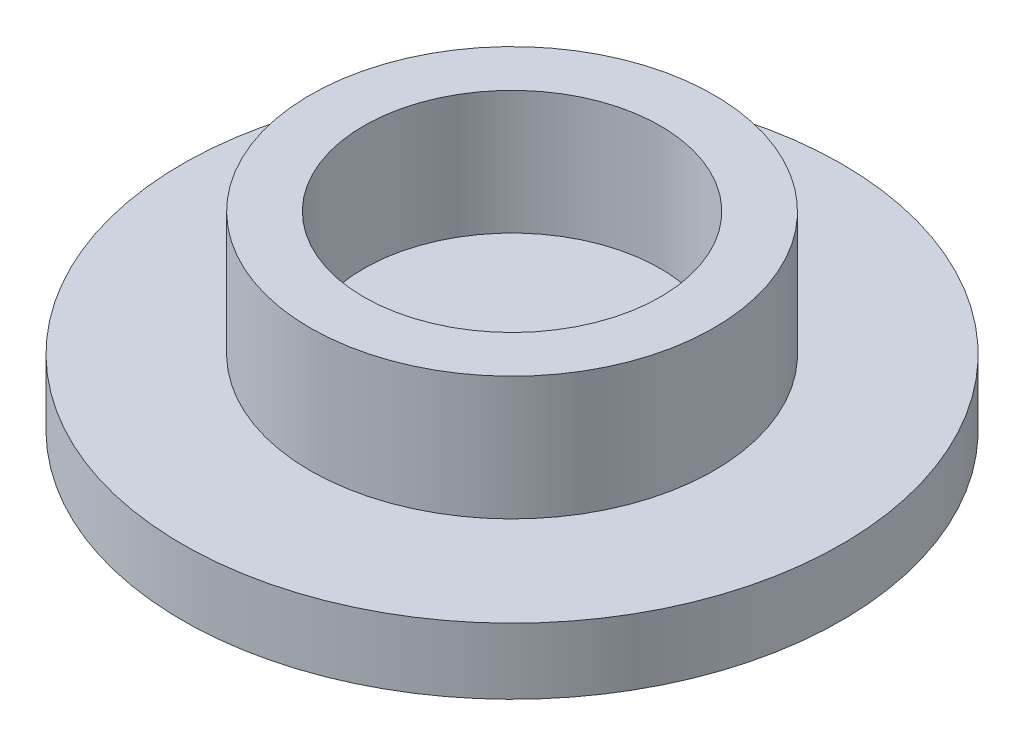
ISO-10303-21;
HEADER;
FILE_DESCRIPTION(('STEP AP214'),'2;1');
FILE_NAME('part.step','',(''),(''),'','','');
FILE_SCHEMA(('AUTOMOTIVE_DESIGN { 1 0 10303 214 1 1 1 1 }'));
ENDSEC;
DATA;
#1=APPLICATION_CONTEXT('core data for automotive mechanical design processes');
#2=APPLICATION_PROTOCOL_DEFINITION('international standard','automotive_design',2000,#1);
#3=PRODUCT_CONTEXT('',#1,'mechanical');
#4=PRODUCT('Part','Part','',(#3));
#5=PRODUCT_RELATED_PRODUCT_CATEGORY('part','',(#4));
#6=PRODUCT_DEFINITION_FORMATION('','',#4);
#7=PRODUCT_DEFINITION_CONTEXT('part definition',#1,'design');
#8=PRODUCT_DEFINITION('design','',#6,#7);
#9=PRODUCT_DEFINITION_SHAPE('','',#8);
#10=(LENGTH_UNIT() NAMED_UNIT(*) SI_UNIT(.MILLI.,.METRE.));
#11=(NAMED_UNIT(*) PLANE_ANGLE_UNIT() SI_UNIT($,.RADIAN.));
#12=(NAMED_UNIT(*) SI_UNIT($,.STERADIAN.) SOLID_ANGLE_UNIT());
#13=UNCERTAINTY_MEASURE_WITH_UNIT(LENGTH_MEASURE(1.E-05),#10,'distance_accuracy_value','');
#14=(GEOMETRIC_REPRESENTATION_CONTEXT(3) GLOBAL_UNCERTAINTY_ASSIGNED_CONTEXT((#13)) GLOBAL_UNIT_ASSIGNED_CONTEXT((#10,
#11,#12)) REPRESENTATION_CONTEXT('',''));
#15=CARTESIAN_POINT('',(0.,0.,0.));
#16=DIRECTION('',(0.,0.,1.));
#17=DIRECTION('',(1.,0.,0.));
#18=AXIS2_PLACEMENT_3D('',#15,#16,#17);
#19=CARTESIAN_POINT('',(0.,1.5,0.));
#20=DIRECTION('',(0.,1.,0.));
#21=DIRECTION('',(0.,0.,1.));
#22=AXIS2_PLACEMENT_3D('',#19,#20,#21);
#23=PLANE('',#22);
#24=CARTESIAN_POINT('',(0.,1.5,0.));
#25=DIRECTION('',(0.,1.,0.));
#26=DIRECTION('',(0.,0.,1.));
#27=AXIS2_PLACEMENT_3D('',#24,#25,#26);
#28=CIRCLE('',#27,2.45);
#29=CARTESIAN_POINT('',(0.,1.5,2.45));
#30=VERTEX_POINT('',#29);
#31=EDGE_CURVE('E10',#30,#30,#28,.T.);
#32=ORIENTED_EDGE('',*,*,#31,.T.);
#33=EDGE_LOOP('',(#32));
#34=FACE_BOUND('',#33,.T.);
#35=CARTESIAN_POINT('',(0.,1.5,0.));
#36=DIRECTION('',(0.,1.,0.));
#37=DIRECTION('',(0.,0.,1.));
#38=AXIS2_PLACEMENT_3D('',#35,#36,#37);
#39=CIRCLE('',#38,1.8);
#40=CARTESIAN_POINT('',(0.,1.5,1.8));
#41=VERTEX_POINT('',#40);
#42=EDGE_CURVE('E41',#41,#41,#39,.T.);
#43=ORIENTED_EDGE('',*,*,#42,.F.);
#44=EDGE_LOOP('',(#43));
#45=FACE_BOUND('',#44,.T.);
#46=ADVANCED_FACE('F33',(#34,#45),#23,.T.);
#47=CARTESIAN_POINT('',(0.,1.5,0.));
#48=DIRECTION('',(0.,-1.,0.));
#49=DIRECTION('',(0.,0.,-1.));
#50=AXIS2_PLACEMENT_3D('',#47,#48,#49);
#51=CYLINDRICAL_SURFACE('',#50,2.45);
#52=ORIENTED_EDGE('',*,*,#31,.F.);
#53=EDGE_LOOP('',(#52));
#54=FACE_BOUND('',#53,.T.);
#55=CARTESIAN_POINT('',(0.,0.,0.));
#56=DIRECTION('',(0.,1.,0.));
#57=DIRECTION('',(0.,0.,1.));
#58=AXIS2_PLACEMENT_3D('',#55,#56,#57);
#59=CIRCLE('',#58,2.45);
#60=CARTESIAN_POINT('',(0.,0.,2.45));
#61=VERTEX_POINT('',#60);
#62=EDGE_CURVE('E37',#61,#61,#59,.T.);
#63=ORIENTED_EDGE('',*,*,#62,.T.);
#64=EDGE_LOOP('',(#63));
#65=FACE_BOUND('',#64,.T.);
#66=ADVANCED_FACE('F35',(#54,#65),#51,.T.);
#67=CARTESIAN_POINT('',(0.,1.5,0.));
#68=DIRECTION('',(0.,-1.,0.));
#69=DIRECTION('',(0.,0.,-1.));
#70=AXIS2_PLACEMENT_3D('',#67,#68,#69);
#71=CYLINDRICAL_SURFACE('',#70,1.8);
#72=ORIENTED_EDGE('',*,*,#42,.T.);
#73=EDGE_LOOP('',(#72));
#74=FACE_BOUND('',#73,.T.);
#75=CARTESIAN_POINT('',(0.,0.,0.));
#76=DIRECTION('',(0.,1.,0.));
#77=DIRECTION('',(0.,0.,1.));
#78=AXIS2_PLACEMENT_3D('',#75,#76,#77);
#79=CIRCLE('',#78,1.8);
#80=CARTESIAN_POINT('',(0.,0.,1.8));
#81=VERTEX_POINT('',#80);
#82=EDGE_CURVE('E45',#81,#81,#79,.T.);
#83=ORIENTED_EDGE('',*,*,#82,.F.);
#84=EDGE_LOOP('',(#83));
#85=FACE_BOUND('',#84,.T.);
#86=ADVANCED_FACE('F78',(#74,#85),#71,.F.);
#87=CARTESIAN_POINT('',(0.,0.,0.));
#88=DIRECTION('',(0.,-1.,0.));
#89=DIRECTION('',(0.,0.,-1.));
#90=AXIS2_PLACEMENT_3D('',#87,#88,#89);
#91=PLANE('',#90);
#92=ORIENTED_EDGE('',*,*,#82,.T.);
#93=EDGE_LOOP('',(#92));
#94=FACE_BOUND('',#93,.T.);
#95=ADVANCED_FACE('F66',(#94),#91,.F.);
#96=CARTESIAN_POINT('',(0.,-0.8,0.));
#97=DIRECTION('',(0.,1.,0.));
#98=DIRECTION('',(0.,0.,1.));
#99=AXIS2_PLACEMENT_3D('',#96,#97,#98);
#100=CYLINDRICAL_SURFACE('',#99,4.);
#101=CARTESIAN_POINT('',(0.,-0.8,0.));
#102=DIRECTION('',(0.,-1.,0.));
#103=DIRECTION('',(0.,0.,-1.));
#104=AXIS2_PLACEMENT_3D('',#101,#102,#103);
#105=CIRCLE('',#104,4.);
#106=CARTESIAN_POINT('',(0.,-0.8,-4.));
#107=VERTEX_POINT('',#106);
#108=EDGE_CURVE('E53',#107,#107,#105,.T.);
#109=ORIENTED_EDGE('',*,*,#108,.F.);
#110=EDGE_LOOP('',(#109));
#111=FACE_BOUND('',#110,.T.);
#112=CARTESIAN_POINT('',(0.,0.,0.));
#113=DIRECTION('',(0.,-1.,0.));
#114=DIRECTION('',(0.,0.,-1.));
#115=AXIS2_PLACEMENT_3D('',#112,#113,#114);
#116=CIRCLE('',#115,4.);
#117=CARTESIAN_POINT('',(0.,0.,-4.));
#118=VERTEX_POINT('',#117);
#119=EDGE_CURVE('E50',#118,#118,#116,.T.);
#120=ORIENTED_EDGE('',*,*,#119,.T.);
#121=EDGE_LOOP('',(#120));
#122=FACE_BOUND('',#121,.T.);
#123=ADVANCED_FACE('F69',(#111,#122),#100,.T.);
#124=CARTESIAN_POINT('',(0.,-0.8,0.));
#125=DIRECTION('',(0.,-1.,0.));
#126=DIRECTION('',(0.,0.,-1.));
#127=AXIS2_PLACEMENT_3D('',#124,#125,#126);
#128=PLANE('',#127);
#129=ORIENTED_EDGE('',*,*,#108,.T.);
#130=EDGE_LOOP('',(#129));
#131=FACE_BOUND('',#130,.T.);
#132=ADVANCED_FACE('F64',(#131),#128,.T.);
#133=ORIENTED_EDGE('',*,*,#62,.F.);
#134=EDGE_LOOP('',(#133));
#135=FACE_BOUND('',#134,.T.);
#136=ORIENTED_EDGE('',*,*,#119,.F.);
#137=EDGE_LOOP('',(#136));
#138=FACE_BOUND('',#137,.T.);
#139=ADVANCED_FACE('F61',(#135,#138),#91,.F.);
#140=CLOSED_SHELL('',(#46,#66,#86,#95,#123,#132,#139));
#141=MANIFOLD_SOLID_BREP('B2',#140);
#142=ADVANCED_BREP_SHAPE_REPRESENTATION('',(#18,#141),#14);
#143=SHAPE_DEFINITION_REPRESENTATION(#9,#142);
ENDSEC;
END-ISO-10303-21;
